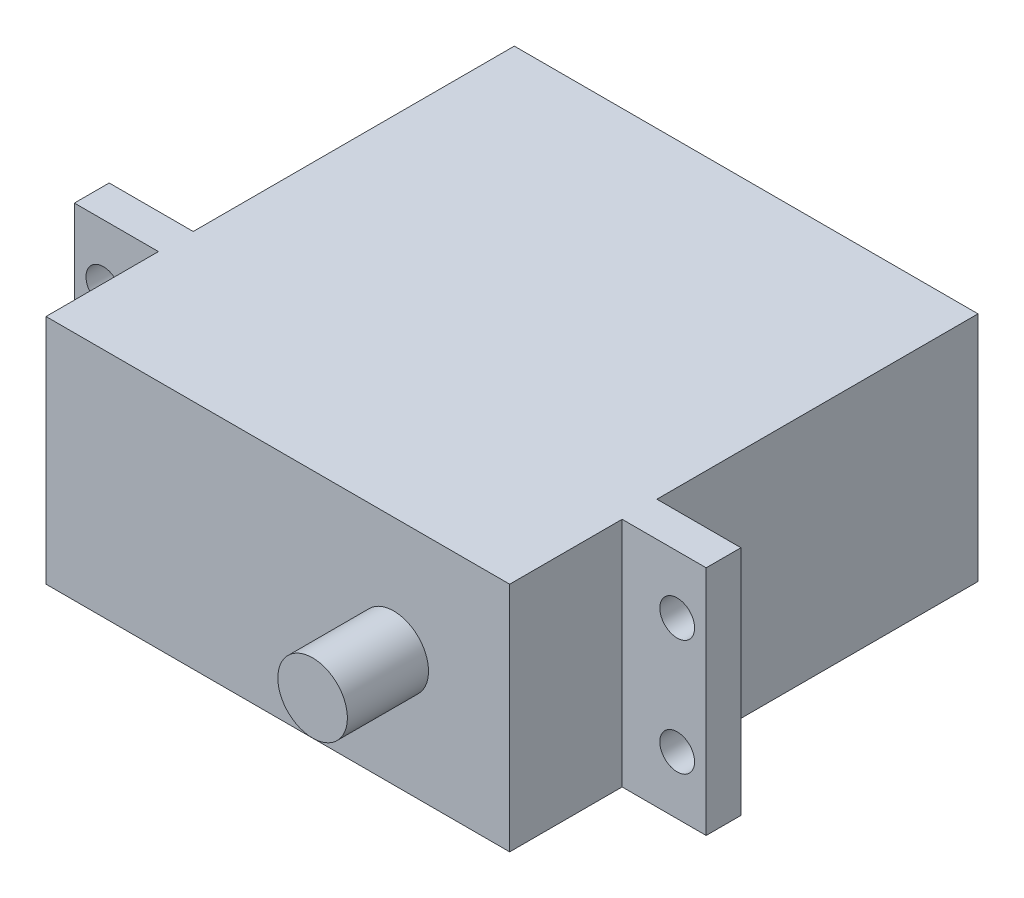
ISO-10303-21;
HEADER;
FILE_DESCRIPTION(('STEP AP214'),'2;1');
FILE_NAME('part.step','',(''),(''),'','','');
FILE_SCHEMA(('AUTOMOTIVE_DESIGN { 1 0 10303 214 1 1 1 1 }'));
ENDSEC;
DATA;
#1=APPLICATION_CONTEXT('core data for automotive mechanical design processes');
#2=APPLICATION_PROTOCOL_DEFINITION('international standard','automotive_design',2000,#1);
#3=PRODUCT_CONTEXT('',#1,'mechanical');
#4=PRODUCT('Part','Part','',(#3));
#5=PRODUCT_RELATED_PRODUCT_CATEGORY('part','',(#4));
#6=PRODUCT_DEFINITION_FORMATION('','',#4);
#7=PRODUCT_DEFINITION_CONTEXT('part definition',#1,'design');
#8=PRODUCT_DEFINITION('design','',#6,#7);
#9=PRODUCT_DEFINITION_SHAPE('','',#8);
#10=(LENGTH_UNIT() NAMED_UNIT(*) SI_UNIT(.MILLI.,.METRE.));
#11=(NAMED_UNIT(*) PLANE_ANGLE_UNIT() SI_UNIT($,.RADIAN.));
#12=(NAMED_UNIT(*) SI_UNIT($,.STERADIAN.) SOLID_ANGLE_UNIT());
#13=UNCERTAINTY_MEASURE_WITH_UNIT(LENGTH_MEASURE(1.E-05),#10,'distance_accuracy_value','');
#14=(GEOMETRIC_REPRESENTATION_CONTEXT(3) GLOBAL_UNCERTAINTY_ASSIGNED_CONTEXT((#13)) GLOBAL_UNIT_ASSIGNED_CONTEXT((#10,
#11,#12)) REPRESENTATION_CONTEXT('',''));
#15=CARTESIAN_POINT('',(0.,0.,0.));
#16=DIRECTION('',(0.,0.,1.));
#17=DIRECTION('',(1.,0.,0.));
#18=AXIS2_PLACEMENT_3D('',#15,#16,#17);
#19=CARTESIAN_POINT('',(-27.6844783715013,20.,-15.2600508905852));
#20=DIRECTION('',(1.,0.,0.));
#21=DIRECTION('',(0.,0.,-1.));
#22=AXIS2_PLACEMENT_3D('',#19,#20,#21);
#23=PLANE('',#22);
#24=DIRECTION('',(0.,0.,1.));
#25=VECTOR('',#24,1.);
#26=CARTESIAN_POINT('',(-27.6844783715013,20.,-15.2600508905852));
#27=LINE('',#26,#25);
#28=CARTESIAN_POINT('',(-27.6844783715013,20.,15.4399491094148));
#29=VERTEX_POINT('',#28);
#30=CARTESIAN_POINT('',(-27.6844783715013,20.,25.1399491094148));
#31=VERTEX_POINT('',#30);
#32=EDGE_CURVE('E192',#29,#31,#27,.T.);
#33=ORIENTED_EDGE('',*,*,#32,.F.);
#34=DIRECTION('',(0.,-1.,0.));
#35=VECTOR('',#34,1.);
#36=CARTESIAN_POINT('',(-27.6844783715013,20.,15.4399491094148));
#37=LINE('',#36,#35);
#38=CARTESIAN_POINT('',(-27.6844783715013,0.,15.4399491094148));
#39=VERTEX_POINT('',#38);
#40=EDGE_CURVE('E133',#29,#39,#37,.T.);
#41=ORIENTED_EDGE('',*,*,#40,.T.);
#42=DIRECTION('',(0.,0.,1.));
#43=VECTOR('',#42,1.);
#44=CARTESIAN_POINT('',(-27.6844783715013,0.,-15.2600508905852));
#45=LINE('',#44,#43);
#46=CARTESIAN_POINT('',(-27.6844783715013,0.,25.1399491094148));
#47=VERTEX_POINT('',#46);
#48=EDGE_CURVE('E188',#39,#47,#45,.T.);
#49=ORIENTED_EDGE('',*,*,#48,.T.);
#50=DIRECTION('',(0.,-1.,0.));
#51=VECTOR('',#50,1.);
#52=CARTESIAN_POINT('',(-27.6844783715013,20.,25.1399491094148));
#53=LINE('',#52,#51);
#54=EDGE_CURVE('E44',#31,#47,#53,.T.);
#55=ORIENTED_EDGE('',*,*,#54,.F.);
#56=EDGE_LOOP('',(#33,#41,#49,#55));
#57=FACE_BOUND('',#56,.T.);
#58=ADVANCED_FACE('F36',(#57),#23,.F.);
#59=CARTESIAN_POINT('',(12.3155216284987,20.,-15.2600508905852));
#60=DIRECTION('',(-1.,0.,0.));
#61=DIRECTION('',(0.,0.,1.));
#62=AXIS2_PLACEMENT_3D('',#59,#60,#61);
#63=PLANE('',#62);
#64=DIRECTION('',(0.,-1.,0.));
#65=VECTOR('',#64,1.);
#66=CARTESIAN_POINT('',(12.3155216284987,20.,15.4399491094148));
#67=LINE('',#66,#65);
#68=CARTESIAN_POINT('',(12.3155216284987,20.,15.4399491094148));
#69=VERTEX_POINT('',#68);
#70=CARTESIAN_POINT('',(12.3155216284987,0.,15.4399491094148));
#71=VERTEX_POINT('',#70);
#72=EDGE_CURVE('E59',#69,#71,#67,.T.);
#73=ORIENTED_EDGE('',*,*,#72,.F.);
#74=DIRECTION('',(0.,0.,-1.));
#75=VECTOR('',#74,1.);
#76=CARTESIAN_POINT('',(12.3155216284987,20.,-15.2600508905852));
#77=LINE('',#76,#75);
#78=CARTESIAN_POINT('',(12.3155216284987,20.,25.1399491094148));
#79=VERTEX_POINT('',#78);
#80=EDGE_CURVE('E195',#79,#69,#77,.T.);
#81=ORIENTED_EDGE('',*,*,#80,.F.);
#82=DIRECTION('',(0.,-1.,0.));
#83=VECTOR('',#82,1.);
#84=CARTESIAN_POINT('',(12.3155216284987,20.,25.1399491094148));
#85=LINE('',#84,#83);
#86=CARTESIAN_POINT('',(12.3155216284987,0.,25.1399491094148));
#87=VERTEX_POINT('',#86);
#88=EDGE_CURVE('E215',#79,#87,#85,.T.);
#89=ORIENTED_EDGE('',*,*,#88,.T.);
#90=DIRECTION('',(0.,0.,-1.));
#91=VECTOR('',#90,1.);
#92=CARTESIAN_POINT('',(12.3155216284987,0.,-15.2600508905852));
#93=LINE('',#92,#91);
#94=EDGE_CURVE('E206',#87,#71,#93,.T.);
#95=ORIENTED_EDGE('',*,*,#94,.T.);
#96=EDGE_LOOP('',(#73,#81,#89,#95));
#97=FACE_BOUND('',#96,.T.);
#98=ADVANCED_FACE('F255',(#97),#63,.F.);
#99=DIRECTION('',(0.,1.,0.));
#100=VECTOR('',#99,1.);
#101=CARTESIAN_POINT('',(12.3155216284987,20.,12.4399491094148));
#102=LINE('',#101,#100);
#103=CARTESIAN_POINT('',(12.3155216284987,0.,12.4399491094148));
#104=VERTEX_POINT('',#103);
#105=CARTESIAN_POINT('',(12.3155216284987,20.,12.4399491094148));
#106=VERTEX_POINT('',#105);
#107=EDGE_CURVE('E167',#104,#106,#102,.T.);
#108=ORIENTED_EDGE('',*,*,#107,.F.);
#109=CARTESIAN_POINT('',(12.3155216284987,0.,-15.2600508905852));
#110=VERTEX_POINT('',#109);
#111=EDGE_CURVE('E205',#104,#110,#93,.T.);
#112=ORIENTED_EDGE('',*,*,#111,.T.);
#113=DIRECTION('',(0.,-1.,0.));
#114=VECTOR('',#113,1.);
#115=CARTESIAN_POINT('',(12.3155216284987,20.,-15.2600508905852));
#116=LINE('',#115,#114);
#117=CARTESIAN_POINT('',(12.3155216284987,20.,-15.2600508905852));
#118=VERTEX_POINT('',#117);
#119=EDGE_CURVE('E212',#118,#110,#116,.T.);
#120=ORIENTED_EDGE('',*,*,#119,.F.);
#121=EDGE_CURVE('E194',#106,#118,#77,.T.);
#122=ORIENTED_EDGE('',*,*,#121,.F.);
#123=EDGE_LOOP('',(#108,#112,#120,#122));
#124=FACE_BOUND('',#123,.T.);
#125=ADVANCED_FACE('F260',(#124),#63,.F.);
#126=CARTESIAN_POINT('',(-27.6844783715013,0.,-15.2600508905852));
#127=VERTEX_POINT('',#126);
#128=CARTESIAN_POINT('',(-27.6844783715013,0.,12.4399491094148));
#129=VERTEX_POINT('',#128);
#130=EDGE_CURVE('E200',#127,#129,#45,.T.);
#131=ORIENTED_EDGE('',*,*,#130,.T.);
#132=DIRECTION('',(0.,1.,0.));
#133=VECTOR('',#132,1.);
#134=CARTESIAN_POINT('',(-27.6844783715013,20.,12.4399491094148));
#135=LINE('',#134,#133);
#136=CARTESIAN_POINT('',(-27.6844783715013,20.,12.4399491094148));
#137=VERTEX_POINT('',#136);
#138=EDGE_CURVE('E145',#129,#137,#135,.T.);
#139=ORIENTED_EDGE('',*,*,#138,.T.);
#140=CARTESIAN_POINT('',(-27.6844783715013,20.,-15.2600508905852));
#141=VERTEX_POINT('',#140);
#142=EDGE_CURVE('E189',#141,#137,#27,.T.);
#143=ORIENTED_EDGE('',*,*,#142,.F.);
#144=DIRECTION('',(0.,-1.,0.));
#145=VECTOR('',#144,1.);
#146=CARTESIAN_POINT('',(-27.6844783715013,20.,-15.2600508905852));
#147=LINE('',#146,#145);
#148=EDGE_CURVE('E199',#141,#127,#147,.T.);
#149=ORIENTED_EDGE('',*,*,#148,.T.);
#150=EDGE_LOOP('',(#131,#139,#143,#149));
#151=FACE_BOUND('',#150,.T.);
#152=ADVANCED_FACE('F38',(#151),#23,.F.);
#153=CARTESIAN_POINT('',(-27.6844783715013,20.,25.1399491094148));
#154=DIRECTION('',(0.,0.,-1.));
#155=DIRECTION('',(-1.,0.,0.));
#156=AXIS2_PLACEMENT_3D('',#153,#154,#155);
#157=PLANE('',#156);
#158=CARTESIAN_POINT('',(2.31552162849872,10.,25.1399491094148));
#159=DIRECTION('',(0.,0.,-1.));
#160=DIRECTION('',(-1.,0.,0.));
#161=AXIS2_PLACEMENT_3D('',#158,#159,#160);
#162=CIRCLE('',#161,3.);
#163=CARTESIAN_POINT('',(-0.684478371501278,10.,25.1399491094148));
#164=VERTEX_POINT('',#163);
#165=EDGE_CURVE('E11',#164,#164,#162,.F.);
#166=ORIENTED_EDGE('',*,*,#165,.F.);
#167=EDGE_LOOP('',(#166));
#168=FACE_BOUND('',#167,.T.);
#169=DIRECTION('',(1.,0.,0.));
#170=VECTOR('',#169,1.);
#171=CARTESIAN_POINT('',(-27.6844783715013,0.,25.1399491094148));
#172=LINE('',#171,#170);
#173=EDGE_CURVE('E203',#47,#87,#172,.T.);
#174=ORIENTED_EDGE('',*,*,#173,.T.);
#175=ORIENTED_EDGE('',*,*,#88,.F.);
#176=DIRECTION('',(1.,0.,0.));
#177=VECTOR('',#176,1.);
#178=CARTESIAN_POINT('',(-27.6844783715013,20.,25.1399491094148));
#179=LINE('',#178,#177);
#180=EDGE_CURVE('E191',#31,#79,#179,.T.);
#181=ORIENTED_EDGE('',*,*,#180,.F.);
#182=ORIENTED_EDGE('',*,*,#54,.T.);
#183=EDGE_LOOP('',(#174,#175,#181,#182));
#184=FACE_BOUND('',#183,.T.);
#185=ADVANCED_FACE('F263',(#168,#184),#157,.F.);
#186=CARTESIAN_POINT('',(-27.6844783715013,20.,-15.2600508905852));
#187=DIRECTION('',(0.,0.,1.));
#188=DIRECTION('',(1.,0.,0.));
#189=AXIS2_PLACEMENT_3D('',#186,#187,#188);
#190=PLANE('',#189);
#191=DIRECTION('',(-1.,0.,0.));
#192=VECTOR('',#191,1.);
#193=CARTESIAN_POINT('',(-27.6844783715013,0.,-15.2600508905852));
#194=LINE('',#193,#192);
#195=EDGE_CURVE('E208',#110,#127,#194,.T.);
#196=ORIENTED_EDGE('',*,*,#195,.T.);
#197=ORIENTED_EDGE('',*,*,#148,.F.);
#198=DIRECTION('',(-1.,0.,0.));
#199=VECTOR('',#198,1.);
#200=CARTESIAN_POINT('',(-27.6844783715013,20.,-15.2600508905852));
#201=LINE('',#200,#199);
#202=EDGE_CURVE('E197',#118,#141,#201,.T.);
#203=ORIENTED_EDGE('',*,*,#202,.F.);
#204=ORIENTED_EDGE('',*,*,#119,.T.);
#205=EDGE_LOOP('',(#196,#197,#203,#204));
#206=FACE_BOUND('',#205,.T.);
#207=ADVANCED_FACE('F269',(#206),#190,.F.);
#208=CARTESIAN_POINT('',(0.,20.,0.));
#209=DIRECTION('',(0.,1.,0.));
#210=DIRECTION('',(0.,0.,1.));
#211=AXIS2_PLACEMENT_3D('',#208,#209,#210);
#212=PLANE('',#211);
#213=ORIENTED_EDGE('',*,*,#142,.T.);
#214=DIRECTION('',(1.,0.,0.));
#215=VECTOR('',#214,1.);
#216=CARTESIAN_POINT('',(-34.9344783715013,20.,12.4399491094148));
#217=LINE('',#216,#215);
#218=CARTESIAN_POINT('',(-34.9344783715013,20.,12.4399491094148));
#219=VERTEX_POINT('',#218);
#220=EDGE_CURVE('E51',#219,#137,#217,.T.);
#221=ORIENTED_EDGE('',*,*,#220,.F.);
#222=DIRECTION('',(0.,0.,1.));
#223=VECTOR('',#222,1.);
#224=CARTESIAN_POINT('',(-34.9344783715013,20.,15.4399491094148));
#225=LINE('',#224,#223);
#226=CARTESIAN_POINT('',(-34.9344783715013,20.,15.4399491094148));
#227=VERTEX_POINT('',#226);
#228=EDGE_CURVE('E142',#219,#227,#225,.T.);
#229=ORIENTED_EDGE('',*,*,#228,.T.);
#230=DIRECTION('',(1.,0.,0.));
#231=VECTOR('',#230,1.);
#232=CARTESIAN_POINT('',(-34.9344783715013,20.,15.4399491094148));
#233=LINE('',#232,#231);
#234=EDGE_CURVE('E127',#227,#29,#233,.T.);
#235=ORIENTED_EDGE('',*,*,#234,.T.);
#236=ORIENTED_EDGE('',*,*,#32,.T.);
#237=ORIENTED_EDGE('',*,*,#180,.T.);
#238=ORIENTED_EDGE('',*,*,#80,.T.);
#239=DIRECTION('',(-1.,0.,0.));
#240=VECTOR('',#239,1.);
#241=CARTESIAN_POINT('',(19.5655216284987,20.,15.4399491094148));
#242=LINE('',#241,#240);
#243=CARTESIAN_POINT('',(19.5655216284987,20.,15.4399491094148));
#244=VERTEX_POINT('',#243);
#245=EDGE_CURVE('E173',#244,#69,#242,.T.);
#246=ORIENTED_EDGE('',*,*,#245,.F.);
#247=DIRECTION('',(0.,0.,1.));
#248=VECTOR('',#247,1.);
#249=CARTESIAN_POINT('',(19.5655216284987,20.,15.4399491094148));
#250=LINE('',#249,#248);
#251=CARTESIAN_POINT('',(19.5655216284987,20.,12.4399491094148));
#252=VERTEX_POINT('',#251);
#253=EDGE_CURVE('E171',#252,#244,#250,.T.);
#254=ORIENTED_EDGE('',*,*,#253,.F.);
#255=DIRECTION('',(-1.,0.,0.));
#256=VECTOR('',#255,1.);
#257=CARTESIAN_POINT('',(19.5655216284987,20.,12.4399491094148));
#258=LINE('',#257,#256);
#259=EDGE_CURVE('E179',#252,#106,#258,.T.);
#260=ORIENTED_EDGE('',*,*,#259,.T.);
#261=ORIENTED_EDGE('',*,*,#121,.T.);
#262=ORIENTED_EDGE('',*,*,#202,.T.);
#263=EDGE_LOOP('',(#213,#221,#229,#235,#236,#237,#238,#246,#254,#260,#261,#262));
#264=FACE_BOUND('',#263,.T.);
#265=ADVANCED_FACE('F148',(#264),#212,.T.);
#266=CARTESIAN_POINT('',(0.,0.,0.));
#267=DIRECTION('',(0.,1.,0.));
#268=DIRECTION('',(0.,0.,1.));
#269=AXIS2_PLACEMENT_3D('',#266,#267,#268);
#270=PLANE('',#269);
#271=ORIENTED_EDGE('',*,*,#130,.F.);
#272=ORIENTED_EDGE('',*,*,#195,.F.);
#273=ORIENTED_EDGE('',*,*,#111,.F.);
#274=DIRECTION('',(-1.,0.,0.));
#275=VECTOR('',#274,1.);
#276=CARTESIAN_POINT('',(19.5655216284987,0.,12.4399491094148));
#277=LINE('',#276,#275);
#278=CARTESIAN_POINT('',(19.5655216284987,0.,12.4399491094148));
#279=VERTEX_POINT('',#278);
#280=EDGE_CURVE('E182',#279,#104,#277,.T.);
#281=ORIENTED_EDGE('',*,*,#280,.F.);
#282=DIRECTION('',(0.,0.,-1.));
#283=VECTOR('',#282,1.);
#284=CARTESIAN_POINT('',(19.5655216284987,0.,15.4399491094147));
#285=LINE('',#284,#283);
#286=CARTESIAN_POINT('',(19.5655216284987,0.,15.4399491094147));
#287=VERTEX_POINT('',#286);
#288=EDGE_CURVE('E166',#287,#279,#285,.T.);
#289=ORIENTED_EDGE('',*,*,#288,.F.);
#290=DIRECTION('',(-1.,0.,0.));
#291=VECTOR('',#290,1.);
#292=CARTESIAN_POINT('',(19.5655216284987,0.,15.4399491094147));
#293=LINE('',#292,#291);
#294=EDGE_CURVE('E185',#287,#71,#293,.T.);
#295=ORIENTED_EDGE('',*,*,#294,.T.);
#296=ORIENTED_EDGE('',*,*,#94,.F.);
#297=ORIENTED_EDGE('',*,*,#173,.F.);
#298=ORIENTED_EDGE('',*,*,#48,.F.);
#299=DIRECTION('',(1.,0.,0.));
#300=VECTOR('',#299,1.);
#301=CARTESIAN_POINT('',(-34.9344783715013,0.,15.4399491094148));
#302=LINE('',#301,#300);
#303=CARTESIAN_POINT('',(-34.9344783715013,0.,15.4399491094148));
#304=VERTEX_POINT('',#303);
#305=EDGE_CURVE('E155',#304,#39,#302,.T.);
#306=ORIENTED_EDGE('',*,*,#305,.F.);
#307=DIRECTION('',(0.,0.,-1.));
#308=VECTOR('',#307,1.);
#309=CARTESIAN_POINT('',(-34.9344783715013,0.,15.4399491094148));
#310=LINE('',#309,#308);
#311=CARTESIAN_POINT('',(-34.9344783715013,0.,12.4399491094148));
#312=VERTEX_POINT('',#311);
#313=EDGE_CURVE('E144',#304,#312,#310,.T.);
#314=ORIENTED_EDGE('',*,*,#313,.T.);
#315=DIRECTION('',(1.,0.,0.));
#316=VECTOR('',#315,1.);
#317=CARTESIAN_POINT('',(-34.9344783715013,0.,12.4399491094148));
#318=LINE('',#317,#316);
#319=EDGE_CURVE('E160',#312,#129,#318,.T.);
#320=ORIENTED_EDGE('',*,*,#319,.T.);
#321=EDGE_LOOP('',(#271,#272,#273,#281,#289,#295,#296,#297,#298,#306,#314,#320));
#322=FACE_BOUND('',#321,.T.);
#323=ADVANCED_FACE('F277',(#322),#270,.F.);
#324=CARTESIAN_POINT('',(19.5655216284987,20.,15.4399491094148));
#325=DIRECTION('',(0.,0.,-1.));
#326=DIRECTION('',(0.,1.,0.));
#327=AXIS2_PLACEMENT_3D('',#324,#325,#326);
#328=PLANE('',#327);
#329=CARTESIAN_POINT('',(17.0655216284987,5.,15.4399491094148));
#330=DIRECTION('',(0.,0.,1.));
#331=DIRECTION('',(1.,0.,0.));
#332=AXIS2_PLACEMENT_3D('',#329,#330,#331);
#333=CIRCLE('',#332,1.5);
#334=CARTESIAN_POINT('',(18.5655216284987,5.,15.4399491094148));
#335=VERTEX_POINT('',#334);
#336=EDGE_CURVE('E423',#335,#335,#333,.T.);
#337=ORIENTED_EDGE('',*,*,#336,.F.);
#338=EDGE_LOOP('',(#337));
#339=FACE_BOUND('',#338,.T.);
#340=CARTESIAN_POINT('',(17.0655216284987,15.,15.4399491094148));
#341=DIRECTION('',(0.,0.,1.));
#342=DIRECTION('',(1.,0.,0.));
#343=AXIS2_PLACEMENT_3D('',#340,#341,#342);
#344=CIRCLE('',#343,1.5);
#345=CARTESIAN_POINT('',(18.5655216284987,15.,15.4399491094148));
#346=VERTEX_POINT('',#345);
#347=EDGE_CURVE('E224',#346,#346,#344,.T.);
#348=ORIENTED_EDGE('',*,*,#347,.F.);
#349=EDGE_LOOP('',(#348));
#350=FACE_BOUND('',#349,.T.);
#351=ORIENTED_EDGE('',*,*,#72,.T.);
#352=ORIENTED_EDGE('',*,*,#294,.F.);
#353=DIRECTION('',(0.,-1.,0.));
#354=VECTOR('',#353,1.);
#355=CARTESIAN_POINT('',(19.5655216284987,20.,15.4399491094148));
#356=LINE('',#355,#354);
#357=EDGE_CURVE('E163',#244,#287,#356,.T.);
#358=ORIENTED_EDGE('',*,*,#357,.F.);
#359=ORIENTED_EDGE('',*,*,#245,.T.);
#360=EDGE_LOOP('',(#351,#352,#358,#359));
#361=FACE_BOUND('',#360,.T.);
#362=ADVANCED_FACE('F300',(#339,#350,#361),#328,.F.);
#363=CARTESIAN_POINT('',(19.5655216284987,20.,12.4399491094148));
#364=DIRECTION('',(0.,0.,1.));
#365=DIRECTION('',(1.,0.,0.));
#366=AXIS2_PLACEMENT_3D('',#363,#364,#365);
#367=PLANE('',#366);
#368=CARTESIAN_POINT('',(17.0655216284987,5.,12.4399491094148));
#369=DIRECTION('',(0.,0.,1.));
#370=DIRECTION('',(1.,0.,0.));
#371=AXIS2_PLACEMENT_3D('',#368,#369,#370);
#372=CIRCLE('',#371,1.5);
#373=CARTESIAN_POINT('',(18.5655216284987,5.,12.4399491094148));
#374=VERTEX_POINT('',#373);
#375=EDGE_CURVE('E157',#374,#374,#372,.T.);
#376=ORIENTED_EDGE('',*,*,#375,.T.);
#377=EDGE_LOOP('',(#376));
#378=FACE_BOUND('',#377,.T.);
#379=CARTESIAN_POINT('',(17.0655216284987,15.,12.4399491094148));
#380=DIRECTION('',(0.,0.,1.));
#381=DIRECTION('',(1.,0.,0.));
#382=AXIS2_PLACEMENT_3D('',#379,#380,#381);
#383=CIRCLE('',#382,1.5);
#384=CARTESIAN_POINT('',(18.5655216284987,15.,12.4399491094148));
#385=VERTEX_POINT('',#384);
#386=EDGE_CURVE('E227',#385,#385,#383,.T.);
#387=ORIENTED_EDGE('',*,*,#386,.T.);
#388=EDGE_LOOP('',(#387));
#389=FACE_BOUND('',#388,.T.);
#390=ORIENTED_EDGE('',*,*,#107,.T.);
#391=ORIENTED_EDGE('',*,*,#259,.F.);
#392=DIRECTION('',(0.,1.,0.));
#393=VECTOR('',#392,1.);
#394=CARTESIAN_POINT('',(19.5655216284987,20.,12.4399491094148));
#395=LINE('',#394,#393);
#396=EDGE_CURVE('E169',#279,#252,#395,.T.);
#397=ORIENTED_EDGE('',*,*,#396,.F.);
#398=ORIENTED_EDGE('',*,*,#280,.T.);
#399=EDGE_LOOP('',(#390,#391,#397,#398));
#400=FACE_BOUND('',#399,.T.);
#401=ADVANCED_FACE('F232',(#378,#389,#400),#367,.F.);
#402=CARTESIAN_POINT('',(19.5655216284987,0.,0.));
#403=DIRECTION('',(1.,0.,0.));
#404=DIRECTION('',(0.,0.,-1.));
#405=AXIS2_PLACEMENT_3D('',#402,#403,#404);
#406=PLANE('',#405);
#407=ORIENTED_EDGE('',*,*,#357,.T.);
#408=ORIENTED_EDGE('',*,*,#288,.T.);
#409=ORIENTED_EDGE('',*,*,#396,.T.);
#410=ORIENTED_EDGE('',*,*,#253,.T.);
#411=EDGE_LOOP('',(#407,#408,#409,#410));
#412=FACE_BOUND('',#411,.T.);
#413=ADVANCED_FACE('F289',(#412),#406,.T.);
#414=CARTESIAN_POINT('',(-34.9344783715013,20.,15.4399491094148));
#415=DIRECTION('',(0.,0.,1.));
#416=DIRECTION('',(0.,-1.,0.));
#417=AXIS2_PLACEMENT_3D('',#414,#415,#416);
#418=PLANE('',#417);
#419=CARTESIAN_POINT('',(-32.4344783715013,15.,15.4399491094148));
#420=DIRECTION('',(0.,0.,1.));
#421=DIRECTION('',(1.,0.,0.));
#422=AXIS2_PLACEMENT_3D('',#419,#420,#421);
#423=CIRCLE('',#422,1.5);
#424=CARTESIAN_POINT('',(-30.9344783715013,15.,15.4399491094148));
#425=VERTEX_POINT('',#424);
#426=EDGE_CURVE('E420',#425,#425,#423,.T.);
#427=ORIENTED_EDGE('',*,*,#426,.F.);
#428=EDGE_LOOP('',(#427));
#429=FACE_BOUND('',#428,.T.);
#430=CARTESIAN_POINT('',(-32.4344783715013,5.,15.4399491094148));
#431=DIRECTION('',(0.,0.,1.));
#432=DIRECTION('',(1.,0.,0.));
#433=AXIS2_PLACEMENT_3D('',#430,#431,#432);
#434=CIRCLE('',#433,1.5);
#435=CARTESIAN_POINT('',(-30.9344783715013,5.,15.4399491094148));
#436=VERTEX_POINT('',#435);
#437=EDGE_CURVE('E417',#436,#436,#434,.T.);
#438=ORIENTED_EDGE('',*,*,#437,.F.);
#439=EDGE_LOOP('',(#438));
#440=FACE_BOUND('',#439,.T.);
#441=ORIENTED_EDGE('',*,*,#40,.F.);
#442=ORIENTED_EDGE('',*,*,#234,.F.);
#443=DIRECTION('',(0.,-1.,0.));
#444=VECTOR('',#443,1.);
#445=CARTESIAN_POINT('',(-34.9344783715013,20.,15.4399491094148));
#446=LINE('',#445,#444);
#447=EDGE_CURVE('E130',#227,#304,#446,.T.);
#448=ORIENTED_EDGE('',*,*,#447,.T.);
#449=ORIENTED_EDGE('',*,*,#305,.T.);
#450=EDGE_LOOP('',(#441,#442,#448,#449));
#451=FACE_BOUND('',#450,.T.);
#452=ADVANCED_FACE('F129',(#429,#440,#451),#418,.T.);
#453=CARTESIAN_POINT('',(-34.9344783715013,20.,12.4399491094148));
#454=DIRECTION('',(0.,0.,-1.));
#455=DIRECTION('',(-1.,0.,0.));
#456=AXIS2_PLACEMENT_3D('',#453,#454,#455);
#457=PLANE('',#456);
#458=CARTESIAN_POINT('',(-32.4344783715013,15.,12.4399491094148));
#459=DIRECTION('',(0.,0.,-1.));
#460=DIRECTION('',(-1.,0.,0.));
#461=AXIS2_PLACEMENT_3D('',#458,#459,#460);
#462=CIRCLE('',#461,1.5);
#463=CARTESIAN_POINT('',(-33.9344783715013,15.,12.4399491094148));
#464=VERTEX_POINT('',#463);
#465=EDGE_CURVE('E223',#464,#464,#462,.T.);
#466=ORIENTED_EDGE('',*,*,#465,.F.);
#467=EDGE_LOOP('',(#466));
#468=FACE_BOUND('',#467,.T.);
#469=CARTESIAN_POINT('',(-32.4344783715013,5.,12.4399491094148));
#470=DIRECTION('',(0.,0.,-1.));
#471=DIRECTION('',(-1.,0.,0.));
#472=AXIS2_PLACEMENT_3D('',#469,#470,#471);
#473=CIRCLE('',#472,1.5);
#474=CARTESIAN_POINT('',(-33.9344783715013,5.,12.4399491094148));
#475=VERTEX_POINT('',#474);
#476=EDGE_CURVE('E220',#475,#475,#473,.T.);
#477=ORIENTED_EDGE('',*,*,#476,.F.);
#478=EDGE_LOOP('',(#477));
#479=FACE_BOUND('',#478,.T.);
#480=ORIENTED_EDGE('',*,*,#138,.F.);
#481=ORIENTED_EDGE('',*,*,#319,.F.);
#482=DIRECTION('',(0.,1.,0.));
#483=VECTOR('',#482,1.);
#484=CARTESIAN_POINT('',(-34.9344783715013,20.,12.4399491094148));
#485=LINE('',#484,#483);
#486=EDGE_CURVE('E149',#312,#219,#485,.T.);
#487=ORIENTED_EDGE('',*,*,#486,.T.);
#488=ORIENTED_EDGE('',*,*,#220,.T.);
#489=EDGE_LOOP('',(#480,#481,#487,#488));
#490=FACE_BOUND('',#489,.T.);
#491=ADVANCED_FACE('F279',(#468,#479,#490),#457,.T.);
#492=CARTESIAN_POINT('',(-34.9344783715013,0.,0.));
#493=DIRECTION('',(-1.,0.,0.));
#494=DIRECTION('',(0.,0.,-1.));
#495=AXIS2_PLACEMENT_3D('',#492,#493,#494);
#496=PLANE('',#495);
#497=ORIENTED_EDGE('',*,*,#447,.F.);
#498=ORIENTED_EDGE('',*,*,#228,.F.);
#499=ORIENTED_EDGE('',*,*,#486,.F.);
#500=ORIENTED_EDGE('',*,*,#313,.F.);
#501=EDGE_LOOP('',(#497,#498,#499,#500));
#502=FACE_BOUND('',#501,.T.);
#503=ADVANCED_FACE('F140',(#502),#496,.T.);
#504=CARTESIAN_POINT('',(-32.4344783715013,5.,8.18994910941475));
#505=DIRECTION('',(0.,0.,1.));
#506=DIRECTION('',(1.,0.,0.));
#507=AXIS2_PLACEMENT_3D('',#504,#505,#506);
#508=CYLINDRICAL_SURFACE('',#507,1.5);
#509=ORIENTED_EDGE('',*,*,#476,.T.);
#510=EDGE_LOOP('',(#509));
#511=FACE_BOUND('',#510,.T.);
#512=ORIENTED_EDGE('',*,*,#437,.T.);
#513=EDGE_LOOP('',(#512));
#514=FACE_BOUND('',#513,.T.);
#515=ADVANCED_FACE('F287',(#511,#514),#508,.F.);
#516=CARTESIAN_POINT('',(-32.4344783715013,15.,8.18994910941475));
#517=DIRECTION('',(0.,0.,1.));
#518=DIRECTION('',(1.,0.,0.));
#519=AXIS2_PLACEMENT_3D('',#516,#517,#518);
#520=CYLINDRICAL_SURFACE('',#519,1.5);
#521=ORIENTED_EDGE('',*,*,#465,.T.);
#522=EDGE_LOOP('',(#521));
#523=FACE_BOUND('',#522,.T.);
#524=ORIENTED_EDGE('',*,*,#426,.T.);
#525=EDGE_LOOP('',(#524));
#526=FACE_BOUND('',#525,.T.);
#527=ADVANCED_FACE('F248',(#523,#526),#520,.F.);
#528=CARTESIAN_POINT('',(17.0655216284987,15.,8.18994910941475));
#529=DIRECTION('',(0.,0.,1.));
#530=DIRECTION('',(1.,0.,0.));
#531=AXIS2_PLACEMENT_3D('',#528,#529,#530);
#532=CYLINDRICAL_SURFACE('',#531,1.5);
#533=ORIENTED_EDGE('',*,*,#347,.T.);
#534=EDGE_LOOP('',(#533));
#535=FACE_BOUND('',#534,.T.);
#536=ORIENTED_EDGE('',*,*,#386,.F.);
#537=EDGE_LOOP('',(#536));
#538=FACE_BOUND('',#537,.T.);
#539=ADVANCED_FACE('F238',(#535,#538),#532,.F.);
#540=CARTESIAN_POINT('',(17.0655216284987,5.,8.18994910941475));
#541=DIRECTION('',(0.,0.,1.));
#542=DIRECTION('',(1.,0.,0.));
#543=AXIS2_PLACEMENT_3D('',#540,#541,#542);
#544=CYLINDRICAL_SURFACE('',#543,1.5);
#545=ORIENTED_EDGE('',*,*,#336,.T.);
#546=EDGE_LOOP('',(#545));
#547=FACE_BOUND('',#546,.T.);
#548=ORIENTED_EDGE('',*,*,#375,.F.);
#549=EDGE_LOOP('',(#548));
#550=FACE_BOUND('',#549,.T.);
#551=ADVANCED_FACE('F235',(#547,#550),#544,.F.);
#552=CARTESIAN_POINT('',(2.31552162849872,10.,32.1399491094148));
#553=DIRECTION('',(0.,0.,-1.));
#554=DIRECTION('',(-1.,0.,0.));
#555=AXIS2_PLACEMENT_3D('',#552,#553,#554);
#556=CYLINDRICAL_SURFACE('',#555,3.);
#557=CARTESIAN_POINT('',(2.31552162849872,10.,32.1399491094148));
#558=DIRECTION('',(0.,0.,1.));
#559=DIRECTION('',(1.,0.,0.));
#560=AXIS2_PLACEMENT_3D('',#557,#558,#559);
#561=CIRCLE('',#560,3.);
#562=CARTESIAN_POINT('',(5.31552162849872,10.,32.1399491094148));
#563=VERTEX_POINT('',#562);
#564=EDGE_CURVE('E416',#563,#563,#561,.T.);
#565=ORIENTED_EDGE('',*,*,#564,.F.);
#566=EDGE_LOOP('',(#565));
#567=FACE_BOUND('',#566,.T.);
#568=ORIENTED_EDGE('',*,*,#165,.T.);
#569=EDGE_LOOP('',(#568));
#570=FACE_BOUND('',#569,.T.);
#571=ADVANCED_FACE('F237',(#567,#570),#556,.T.);
#572=CARTESIAN_POINT('',(2.31552162849872,10.,32.1399491094148));
#573=DIRECTION('',(0.,0.,1.));
#574=DIRECTION('',(1.,0.,0.));
#575=AXIS2_PLACEMENT_3D('',#572,#573,#574);
#576=PLANE('',#575);
#577=ORIENTED_EDGE('',*,*,#564,.T.);
#578=EDGE_LOOP('',(#577));
#579=FACE_BOUND('',#578,.T.);
#580=ADVANCED_FACE('F245',(#579),#576,.T.);
#581=CLOSED_SHELL('',(#58,#98,#125,#152,#185,#207,#265,#323,#362,#401,#413,#452,#491,#503,#515,
#527,#539,#551,#571,#580));
#582=MANIFOLD_SOLID_BREP('B2',#581);
#583=ADVANCED_BREP_SHAPE_REPRESENTATION('',(#18,#582),#14);
#584=SHAPE_DEFINITION_REPRESENTATION(#9,#583);
ENDSEC;
END-ISO-10303-21;
